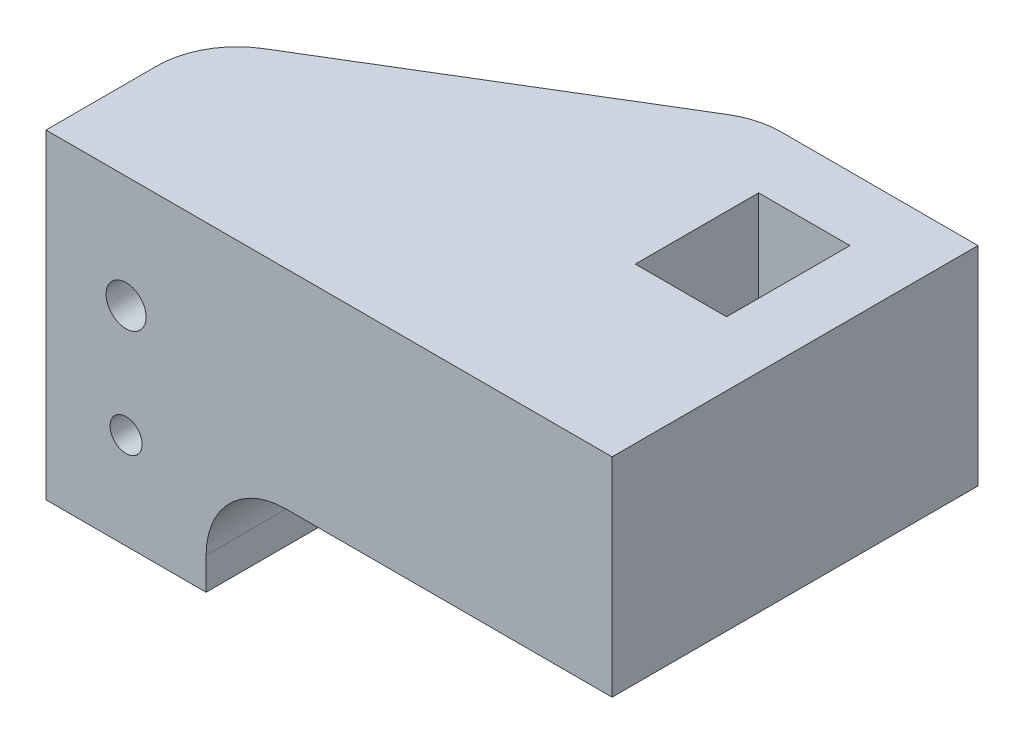
ISO-10303-21;
HEADER;
FILE_DESCRIPTION(('STEP AP214'),'2;1');
FILE_NAME('part.step','',(''),(''),'','','');
FILE_SCHEMA(('AUTOMOTIVE_DESIGN { 1 0 10303 214 1 1 1 1 }'));
ENDSEC;
DATA;
#1=APPLICATION_CONTEXT('core data for automotive mechanical design processes');
#2=APPLICATION_PROTOCOL_DEFINITION('international standard','automotive_design',2000,#1);
#3=PRODUCT_CONTEXT('',#1,'mechanical');
#4=PRODUCT('Part','Part','',(#3));
#5=PRODUCT_RELATED_PRODUCT_CATEGORY('part','',(#4));
#6=PRODUCT_DEFINITION_FORMATION('','',#4);
#7=PRODUCT_DEFINITION_CONTEXT('part definition',#1,'design');
#8=PRODUCT_DEFINITION('design','',#6,#7);
#9=PRODUCT_DEFINITION_SHAPE('','',#8);
#10=(LENGTH_UNIT() NAMED_UNIT(*) SI_UNIT(.MILLI.,.METRE.));
#11=(NAMED_UNIT(*) PLANE_ANGLE_UNIT() SI_UNIT($,.RADIAN.));
#12=(NAMED_UNIT(*) SI_UNIT($,.STERADIAN.) SOLID_ANGLE_UNIT());
#13=UNCERTAINTY_MEASURE_WITH_UNIT(LENGTH_MEASURE(1.E-05),#10,'distance_accuracy_value','');
#14=(GEOMETRIC_REPRESENTATION_CONTEXT(3) GLOBAL_UNCERTAINTY_ASSIGNED_CONTEXT((#13)) GLOBAL_UNIT_ASSIGNED_CONTEXT((#10,
#11,#12)) REPRESENTATION_CONTEXT('',''));
#15=CARTESIAN_POINT('',(0.,0.,0.));
#16=DIRECTION('',(0.,0.,1.));
#17=DIRECTION('',(1.,0.,0.));
#18=AXIS2_PLACEMENT_3D('',#15,#16,#17);
#19=CARTESIAN_POINT('',(0.,20.,0.));
#20=DIRECTION('',(0.,1.,0.));
#21=DIRECTION('',(0.,0.,1.));
#22=AXIS2_PLACEMENT_3D('',#19,#20,#21);
#23=PLANE('',#22);
#24=DIRECTION('',(-1.,0.,0.));
#25=VECTOR('',#24,1.);
#26=CARTESIAN_POINT('',(-25.65,20.,-17.85));
#27=LINE('',#26,#25);
#28=CARTESIAN_POINT('',(-25.65,20.,-17.85));
#29=VERTEX_POINT('',#28);
#30=CARTESIAN_POINT('',(-37.9550666763264,20.,-17.85));
#31=VERTEX_POINT('',#30);
#32=EDGE_CURVE('E160',#29,#31,#27,.T.);
#33=ORIENTED_EDGE('',*,*,#32,.T.);
#34=CARTESIAN_POINT('',(-37.9550666763264,20.,-12.85));
#35=DIRECTION('',(0.,1.,0.));
#36=DIRECTION('',(0.,0.,1.));
#37=AXIS2_PLACEMENT_3D('',#34,#35,#36);
#38=CIRCLE('',#37,5.);
#39=CARTESIAN_POINT('',(-40.5434687758837,20.,-17.1278703312522));
#40=VERTEX_POINT('',#39);
#41=EDGE_CURVE('E204',#31,#40,#38,.T.);
#42=ORIENTED_EDGE('',*,*,#41,.T.);
#43=DIRECTION('',(-0.855574066250431,0.,0.517680419911457));
#44=VECTOR('',#43,1.);
#45=CARTESIAN_POINT('',(-39.35,20.,-17.85));
#46=LINE('',#45,#44);
#47=CARTESIAN_POINT('',(-58.5884020995573,20.,-6.20946007460082));
#48=VERTEX_POINT('',#47);
#49=EDGE_CURVE('E161',#40,#48,#46,.T.);
#50=ORIENTED_EDGE('',*,*,#49,.T.);
#51=CARTESIAN_POINT('',(-56.,20.,-1.93158974334867));
#52=DIRECTION('',(0.,1.,0.));
#53=DIRECTION('',(0.,0.,1.));
#54=AXIS2_PLACEMENT_3D('',#51,#52,#53);
#55=CIRCLE('',#54,5.);
#56=CARTESIAN_POINT('',(-61.,20.,-1.93158974334867));
#57=VERTEX_POINT('',#56);
#58=EDGE_CURVE('E54',#48,#57,#55,.T.);
#59=ORIENTED_EDGE('',*,*,#58,.T.);
#60=DIRECTION('',(0.,0.,1.));
#61=VECTOR('',#60,1.);
#62=CARTESIAN_POINT('',(-61.,20.,-4.75027955124758));
#63=LINE('',#62,#61);
#64=CARTESIAN_POINT('',(-61.,20.,5.00000000000001));
#65=VERTEX_POINT('',#64);
#66=EDGE_CURVE('E211',#57,#65,#63,.T.);
#67=ORIENTED_EDGE('',*,*,#66,.T.);
#68=DIRECTION('',(1.,0.,0.));
#69=VECTOR('',#68,1.);
#70=CARTESIAN_POINT('',(-61.,20.,5.00000000000001));
#71=LINE('',#70,#69);
#72=CARTESIAN_POINT('',(-25.65,20.,5.00000000000001));
#73=VERTEX_POINT('',#72);
#74=EDGE_CURVE('E228',#65,#73,#71,.T.);
#75=ORIENTED_EDGE('',*,*,#74,.T.);
#76=DIRECTION('',(0.,0.,-1.));
#77=VECTOR('',#76,1.);
#78=CARTESIAN_POINT('',(-25.65,20.,5.00000000000001));
#79=LINE('',#78,#77);
#80=EDGE_CURVE('E226',#73,#29,#79,.T.);
#81=ORIENTED_EDGE('',*,*,#80,.T.);
#82=EDGE_LOOP('',(#33,#42,#50,#59,#67,#75,#81));
#83=FACE_BOUND('',#82,.T.);
#84=DIRECTION('',(1.,0.,0.));
#85=VECTOR('',#84,1.);
#86=CARTESIAN_POINT('',(-35.35,20.,-6.15));
#87=LINE('',#86,#85);
#88=CARTESIAN_POINT('',(-35.35,20.,-6.15));
#89=VERTEX_POINT('',#88);
#90=CARTESIAN_POINT('',(-29.65,20.,-6.15));
#91=VERTEX_POINT('',#90);
#92=EDGE_CURVE('E244',#89,#91,#87,.T.);
#93=ORIENTED_EDGE('',*,*,#92,.F.);
#94=DIRECTION('',(0.,0.,1.));
#95=VECTOR('',#94,1.);
#96=CARTESIAN_POINT('',(-35.35,20.,-13.85));
#97=LINE('',#96,#95);
#98=CARTESIAN_POINT('',(-35.35,20.,-13.85));
#99=VERTEX_POINT('',#98);
#100=EDGE_CURVE('E176',#99,#89,#97,.T.);
#101=ORIENTED_EDGE('',*,*,#100,.F.);
#102=DIRECTION('',(-1.,0.,0.));
#103=VECTOR('',#102,1.);
#104=CARTESIAN_POINT('',(-35.35,20.,-13.85));
#105=LINE('',#104,#103);
#106=CARTESIAN_POINT('',(-29.65,20.,-13.85));
#107=VERTEX_POINT('',#106);
#108=EDGE_CURVE('E239',#107,#99,#105,.T.);
#109=ORIENTED_EDGE('',*,*,#108,.F.);
#110=DIRECTION('',(0.,0.,-1.));
#111=VECTOR('',#110,1.);
#112=CARTESIAN_POINT('',(-29.65,20.,-13.85));
#113=LINE('',#112,#111);
#114=EDGE_CURVE('E241',#91,#107,#113,.T.);
#115=ORIENTED_EDGE('',*,*,#114,.F.);
#116=EDGE_LOOP('',(#93,#101,#109,#115));
#117=FACE_BOUND('',#116,.T.);
#118=ADVANCED_FACE('F33',(#83,#117),#23,.T.);
#119=CARTESIAN_POINT('',(0.,0.,0.));
#120=DIRECTION('',(0.,1.,0.));
#121=DIRECTION('',(0.,0.,1.));
#122=AXIS2_PLACEMENT_3D('',#119,#120,#121);
#123=PLANE('',#122);
#124=DIRECTION('',(0.,0.,1.));
#125=VECTOR('',#124,1.);
#126=CARTESIAN_POINT('',(-61.,0.,-4.75027955124758));
#127=LINE('',#126,#125);
#128=CARTESIAN_POINT('',(-61.,0.,-1.93158974334867));
#129=VERTEX_POINT('',#128);
#130=CARTESIAN_POINT('',(-61.,0.,5.00000000000001));
#131=VERTEX_POINT('',#130);
#132=EDGE_CURVE('E209',#129,#131,#127,.T.);
#133=ORIENTED_EDGE('',*,*,#132,.F.);
#134=CARTESIAN_POINT('',(-56.,0.,-1.93158974334867));
#135=DIRECTION('',(0.,1.,0.));
#136=DIRECTION('',(0.,0.,1.));
#137=AXIS2_PLACEMENT_3D('',#134,#135,#136);
#138=CIRCLE('',#137,5.);
#139=CARTESIAN_POINT('',(-58.5884020995573,0.,-6.20946007460082));
#140=VERTEX_POINT('',#139);
#141=EDGE_CURVE('E11',#129,#140,#138,.F.);
#142=ORIENTED_EDGE('',*,*,#141,.T.);
#143=DIRECTION('',(-0.855574066250431,0.,0.517680419911457));
#144=VECTOR('',#143,1.);
#145=CARTESIAN_POINT('',(-39.35,0.,-17.85));
#146=LINE('',#145,#144);
#147=CARTESIAN_POINT('',(-51.,0.,-10.8009587423572));
#148=VERTEX_POINT('',#147);
#149=EDGE_CURVE('E167',#148,#140,#146,.T.);
#150=ORIENTED_EDGE('',*,*,#149,.F.);
#151=DIRECTION('',(0.,0.,1.));
#152=VECTOR('',#151,1.);
#153=CARTESIAN_POINT('',(-51.,0.,-17.85));
#154=LINE('',#153,#152);
#155=CARTESIAN_POINT('',(-51.,0.,5.00000000000001));
#156=VERTEX_POINT('',#155);
#157=EDGE_CURVE('E144',#148,#156,#154,.T.);
#158=ORIENTED_EDGE('',*,*,#157,.T.);
#159=DIRECTION('',(1.,0.,0.));
#160=VECTOR('',#159,1.);
#161=CARTESIAN_POINT('',(-51.5842691136,0.,5.00000000000001));
#162=LINE('',#161,#160);
#163=EDGE_CURVE('E218',#131,#156,#162,.T.);
#164=ORIENTED_EDGE('',*,*,#163,.F.);
#165=EDGE_LOOP('',(#133,#142,#150,#158,#164));
#166=FACE_BOUND('',#165,.T.);
#167=ADVANCED_FACE('F213',(#166),#123,.F.);
#168=CARTESIAN_POINT('',(-61.,20.,-4.75027955124758));
#169=DIRECTION('',(1.,0.,0.));
#170=DIRECTION('',(0.,0.,-1.));
#171=AXIS2_PLACEMENT_3D('',#168,#169,#170);
#172=PLANE('',#171);
#173=ORIENTED_EDGE('',*,*,#66,.F.);
#174=DIRECTION('',(0.,-1.,0.));
#175=VECTOR('',#174,1.);
#176=CARTESIAN_POINT('',(-61.,20.,-1.93158974334867));
#177=LINE('',#176,#175);
#178=EDGE_CURVE('E41',#57,#129,#177,.T.);
#179=ORIENTED_EDGE('',*,*,#178,.T.);
#180=ORIENTED_EDGE('',*,*,#132,.T.);
#181=DIRECTION('',(0.,-1.,0.));
#182=VECTOR('',#181,1.);
#183=CARTESIAN_POINT('',(-61.,20.,5.00000000000001));
#184=LINE('',#183,#182);
#185=EDGE_CURVE('E163',#65,#131,#184,.T.);
#186=ORIENTED_EDGE('',*,*,#185,.F.);
#187=EDGE_LOOP('',(#173,#179,#180,#186));
#188=FACE_BOUND('',#187,.T.);
#189=ADVANCED_FACE('F207',(#188),#172,.F.);
#190=CARTESIAN_POINT('',(-51.5842691136,20.,5.00000000000001));
#191=DIRECTION('',(0.,0.,-1.));
#192=DIRECTION('',(-1.,0.,0.));
#193=AXIS2_PLACEMENT_3D('',#190,#191,#192);
#194=PLANE('',#193);
#195=CARTESIAN_POINT('',(-56.,5.99990119850436,5.00000000000001));
#196=DIRECTION('',(0.,0.,1.));
#197=DIRECTION('',(1.,0.,0.));
#198=AXIS2_PLACEMENT_3D('',#195,#196,#197);
#199=CIRCLE('',#198,0.999999999999998);
#200=CARTESIAN_POINT('',(-55.,5.99990119850436,5.00000000000001));
#201=VERTEX_POINT('',#200);
#202=EDGE_CURVE('E156',#201,#201,#199,.T.);
#203=ORIENTED_EDGE('',*,*,#202,.F.);
#204=EDGE_LOOP('',(#203));
#205=FACE_BOUND('',#204,.T.);
#206=CARTESIAN_POINT('',(-56.,12.9999011985044,5.00000000000001));
#207=DIRECTION('',(0.,0.,1.));
#208=DIRECTION('',(1.,0.,0.));
#209=AXIS2_PLACEMENT_3D('',#206,#207,#208);
#210=CIRCLE('',#209,1.25000000000001);
#211=CARTESIAN_POINT('',(-54.75,12.9999011985044,5.00000000000001));
#212=VERTEX_POINT('',#211);
#213=EDGE_CURVE('E177',#212,#212,#210,.T.);
#214=ORIENTED_EDGE('',*,*,#213,.F.);
#215=EDGE_LOOP('',(#214));
#216=FACE_BOUND('',#215,.T.);
#217=ORIENTED_EDGE('',*,*,#163,.T.);
#218=DIRECTION('',(0.,-1.,0.));
#219=VECTOR('',#218,1.);
#220=CARTESIAN_POINT('',(-51.,0.,5.00000000000001));
#221=LINE('',#220,#219);
#222=CARTESIAN_POINT('',(-51.,2.,5.00000000000001));
#223=VERTEX_POINT('',#222);
#224=EDGE_CURVE('E258',#223,#156,#221,.T.);
#225=ORIENTED_EDGE('',*,*,#224,.F.);
#226=CARTESIAN_POINT('',(-46.,2.,5.00000000000001));
#227=DIRECTION('',(0.,0.,-1.));
#228=DIRECTION('',(-1.,0.,0.));
#229=AXIS2_PLACEMENT_3D('',#226,#227,#228);
#230=CIRCLE('',#229,5.);
#231=CARTESIAN_POINT('',(-46.,7.,5.00000000000001));
#232=VERTEX_POINT('',#231);
#233=EDGE_CURVE('E191',#223,#232,#230,.T.);
#234=ORIENTED_EDGE('',*,*,#233,.T.);
#235=DIRECTION('',(-1.,0.,0.));
#236=VECTOR('',#235,1.);
#237=CARTESIAN_POINT('',(-51.,7.,5.00000000000001));
#238=LINE('',#237,#236);
#239=CARTESIAN_POINT('',(-25.65,7.,5.00000000000001));
#240=VERTEX_POINT('',#239);
#241=EDGE_CURVE('E145',#240,#232,#238,.T.);
#242=ORIENTED_EDGE('',*,*,#241,.F.);
#243=DIRECTION('',(0.,-1.,0.));
#244=VECTOR('',#243,1.);
#245=CARTESIAN_POINT('',(-25.65,20.,5.00000000000001));
#246=LINE('',#245,#244);
#247=EDGE_CURVE('E155',#73,#240,#246,.T.);
#248=ORIENTED_EDGE('',*,*,#247,.F.);
#249=ORIENTED_EDGE('',*,*,#74,.F.);
#250=ORIENTED_EDGE('',*,*,#185,.T.);
#251=EDGE_LOOP('',(#217,#225,#234,#242,#248,#249,#250));
#252=FACE_BOUND('',#251,.T.);
#253=ADVANCED_FACE('F266',(#205,#216,#252),#194,.F.);
#254=CARTESIAN_POINT('',(-25.65,20.,5.00000000000001));
#255=DIRECTION('',(-1.,0.,0.));
#256=DIRECTION('',(0.,0.,1.));
#257=AXIS2_PLACEMENT_3D('',#254,#255,#256);
#258=PLANE('',#257);
#259=ORIENTED_EDGE('',*,*,#247,.T.);
#260=DIRECTION('',(0.,0.,1.));
#261=VECTOR('',#260,1.);
#262=CARTESIAN_POINT('',(-25.65,7.,-17.85));
#263=LINE('',#262,#261);
#264=CARTESIAN_POINT('',(-25.65,7.,-17.85));
#265=VERTEX_POINT('',#264);
#266=EDGE_CURVE('E138',#265,#240,#263,.T.);
#267=ORIENTED_EDGE('',*,*,#266,.F.);
#268=DIRECTION('',(0.,-1.,0.));
#269=VECTOR('',#268,1.);
#270=CARTESIAN_POINT('',(-25.65,20.,-17.85));
#271=LINE('',#270,#269);
#272=EDGE_CURVE('E152',#29,#265,#271,.T.);
#273=ORIENTED_EDGE('',*,*,#272,.F.);
#274=ORIENTED_EDGE('',*,*,#80,.F.);
#275=EDGE_LOOP('',(#259,#267,#273,#274));
#276=FACE_BOUND('',#275,.T.);
#277=ADVANCED_FACE('F150',(#276),#258,.F.);
#278=CARTESIAN_POINT('',(-25.65,20.,-17.85));
#279=DIRECTION('',(0.,0.,1.));
#280=DIRECTION('',(1.,0.,0.));
#281=AXIS2_PLACEMENT_3D('',#278,#279,#280);
#282=PLANE('',#281);
#283=DIRECTION('',(-1.,0.,0.));
#284=VECTOR('',#283,1.);
#285=CARTESIAN_POINT('',(-51.,7.,-17.85));
#286=LINE('',#285,#284);
#287=CARTESIAN_POINT('',(-37.9550666763264,7.,-17.85));
#288=VERTEX_POINT('',#287);
#289=EDGE_CURVE('E133',#265,#288,#286,.T.);
#290=ORIENTED_EDGE('',*,*,#289,.T.);
#291=DIRECTION('',(0.,-1.,0.));
#292=VECTOR('',#291,1.);
#293=CARTESIAN_POINT('',(-37.9550666763264,20.,-17.85));
#294=LINE('',#293,#292);
#295=EDGE_CURVE('E201',#288,#31,#294,.F.);
#296=ORIENTED_EDGE('',*,*,#295,.T.);
#297=ORIENTED_EDGE('',*,*,#32,.F.);
#298=ORIENTED_EDGE('',*,*,#272,.T.);
#299=EDGE_LOOP('',(#290,#296,#297,#298));
#300=FACE_BOUND('',#299,.T.);
#301=ADVANCED_FACE('F158',(#300),#282,.F.);
#302=CARTESIAN_POINT('',(-39.35,20.,-17.85));
#303=DIRECTION('',(0.517680419911457,0.,0.855574066250431));
#304=DIRECTION('',(0.855574066250431,0.,-0.517680419911457));
#305=AXIS2_PLACEMENT_3D('',#302,#303,#304);
#306=PLANE('',#305);
#307=CARTESIAN_POINT('',(-56.,5.99990119850436,-7.77561914680241));
#308=DIRECTION('',(0.517680419911457,0.,0.855574066250431));
#309=DIRECTION('',(-0.855574066250431,0.,0.517680419911457));
#310=AXIS2_PLACEMENT_3D('',#307,#308,#309);
#311=ELLIPSE('',#310,1.16880588069075,0.999999999999998);
#312=CARTESIAN_POINT('',(-57.,5.99990119850436,-7.17055122769144));
#313=VERTEX_POINT('',#312);
#314=EDGE_CURVE('E182',#313,#313,#311,.T.);
#315=ORIENTED_EDGE('',*,*,#314,.T.);
#316=EDGE_LOOP('',(#315));
#317=FACE_BOUND('',#316,.T.);
#318=CARTESIAN_POINT('',(-56.,12.9999011985044,-7.77561914680241));
#319=DIRECTION('',(0.517680419911457,0.,0.855574066250431));
#320=DIRECTION('',(-0.855574066250431,0.,0.517680419911457));
#321=AXIS2_PLACEMENT_3D('',#318,#319,#320);
#322=ELLIPSE('',#321,1.46100735086344,1.25000000000001);
#323=CARTESIAN_POINT('',(-57.25,12.9999011985044,-7.01928424791369));
#324=VERTEX_POINT('',#323);
#325=EDGE_CURVE('E173',#324,#324,#322,.T.);
#326=ORIENTED_EDGE('',*,*,#325,.T.);
#327=EDGE_LOOP('',(#326));
#328=FACE_BOUND('',#327,.T.);
#329=ORIENTED_EDGE('',*,*,#49,.F.);
#330=DIRECTION('',(0.,-1.,0.));
#331=VECTOR('',#330,1.);
#332=CARTESIAN_POINT('',(-40.5434687758837,20.,-17.1278703312522));
#333=LINE('',#332,#331);
#334=CARTESIAN_POINT('',(-40.5434687758837,7.,-17.1278703312522));
#335=VERTEX_POINT('',#334);
#336=EDGE_CURVE('E197',#40,#335,#333,.T.);
#337=ORIENTED_EDGE('',*,*,#336,.T.);
#338=DIRECTION('',(-0.855574066250432,0.,0.517680419911457));
#339=VECTOR('',#338,1.);
#340=CARTESIAN_POINT('',(-39.35,7.,-17.85));
#341=LINE('',#340,#339);
#342=CARTESIAN_POINT('',(-46.,7.,-13.8262983379121));
#343=VERTEX_POINT('',#342);
#344=EDGE_CURVE('E185',#335,#343,#341,.T.);
#345=ORIENTED_EDGE('',*,*,#344,.T.);
#346=CARTESIAN_POINT('',(-46.,2.,-13.8262983379121));
#347=DIRECTION('',(0.517680419911457,0.,0.855574066250431));
#348=DIRECTION('',(0.855574066250431,0.,-0.517680419911457));
#349=AXIS2_PLACEMENT_3D('',#346,#347,#348);
#350=ELLIPSE('',#349,5.84402940345374,5.);
#351=CARTESIAN_POINT('',(-51.,2.00000000000001,-10.8009587423572));
#352=VERTEX_POINT('',#351);
#353=EDGE_CURVE('E193',#343,#352,#350,.T.);
#354=ORIENTED_EDGE('',*,*,#353,.T.);
#355=DIRECTION('',(0.,-1.,0.));
#356=VECTOR('',#355,1.);
#357=CARTESIAN_POINT('',(-51.,20.,-10.8009587423572));
#358=LINE('',#357,#356);
#359=EDGE_CURVE('E179',#352,#148,#358,.T.);
#360=ORIENTED_EDGE('',*,*,#359,.T.);
#361=ORIENTED_EDGE('',*,*,#149,.T.);
#362=DIRECTION('',(0.,-1.,0.));
#363=VECTOR('',#362,1.);
#364=CARTESIAN_POINT('',(-58.5884020995573,20.,-6.20946007460082));
#365=LINE('',#364,#363);
#366=EDGE_CURVE('E195',#140,#48,#365,.F.);
#367=ORIENTED_EDGE('',*,*,#366,.T.);
#368=EDGE_LOOP('',(#329,#337,#345,#354,#360,#361,#367));
#369=FACE_BOUND('',#368,.T.);
#370=ADVANCED_FACE('F281',(#317,#328,#369),#306,.F.);
#371=CARTESIAN_POINT('',(-35.35,20.,-13.85));
#372=DIRECTION('',(1.,0.,0.));
#373=DIRECTION('',(0.,0.,-1.));
#374=AXIS2_PLACEMENT_3D('',#371,#372,#373);
#375=PLANE('',#374);
#376=DIRECTION('',(0.,0.,1.));
#377=VECTOR('',#376,1.);
#378=CARTESIAN_POINT('',(-35.35,7.,-13.85));
#379=LINE('',#378,#377);
#380=CARTESIAN_POINT('',(-35.35,7.,-13.85));
#381=VERTEX_POINT('',#380);
#382=CARTESIAN_POINT('',(-35.35,7.,-6.15));
#383=VERTEX_POINT('',#382);
#384=EDGE_CURVE('E250',#381,#383,#379,.T.);
#385=ORIENTED_EDGE('',*,*,#384,.F.);
#386=DIRECTION('',(0.,-1.,0.));
#387=VECTOR('',#386,1.);
#388=CARTESIAN_POINT('',(-35.35,20.,-13.85));
#389=LINE('',#388,#387);
#390=EDGE_CURVE('E236',#99,#381,#389,.T.);
#391=ORIENTED_EDGE('',*,*,#390,.F.);
#392=ORIENTED_EDGE('',*,*,#100,.T.);
#393=DIRECTION('',(0.,-1.,0.));
#394=VECTOR('',#393,1.);
#395=CARTESIAN_POINT('',(-35.35,20.,-6.15));
#396=LINE('',#395,#394);
#397=EDGE_CURVE('E219',#89,#383,#396,.T.);
#398=ORIENTED_EDGE('',*,*,#397,.T.);
#399=EDGE_LOOP('',(#385,#391,#392,#398));
#400=FACE_BOUND('',#399,.T.);
#401=ADVANCED_FACE('F302',(#400),#375,.T.);
#402=CARTESIAN_POINT('',(-35.35,20.,-6.15));
#403=DIRECTION('',(0.,0.,-1.));
#404=DIRECTION('',(-1.,0.,0.));
#405=AXIS2_PLACEMENT_3D('',#402,#403,#404);
#406=PLANE('',#405);
#407=DIRECTION('',(1.,0.,0.));
#408=VECTOR('',#407,1.);
#409=CARTESIAN_POINT('',(-35.35,7.,-6.15));
#410=LINE('',#409,#408);
#411=CARTESIAN_POINT('',(-29.65,7.,-6.15));
#412=VERTEX_POINT('',#411);
#413=EDGE_CURVE('E252',#383,#412,#410,.T.);
#414=ORIENTED_EDGE('',*,*,#413,.F.);
#415=ORIENTED_EDGE('',*,*,#397,.F.);
#416=ORIENTED_EDGE('',*,*,#92,.T.);
#417=DIRECTION('',(0.,-1.,0.));
#418=VECTOR('',#417,1.);
#419=CARTESIAN_POINT('',(-29.65,20.,-6.15));
#420=LINE('',#419,#418);
#421=EDGE_CURVE('E222',#91,#412,#420,.T.);
#422=ORIENTED_EDGE('',*,*,#421,.T.);
#423=EDGE_LOOP('',(#414,#415,#416,#422));
#424=FACE_BOUND('',#423,.T.);
#425=ADVANCED_FACE('F337',(#424),#406,.T.);
#426=CARTESIAN_POINT('',(-29.65,20.,-13.85));
#427=DIRECTION('',(-1.,0.,0.));
#428=DIRECTION('',(0.,0.,1.));
#429=AXIS2_PLACEMENT_3D('',#426,#427,#428);
#430=PLANE('',#429);
#431=DIRECTION('',(0.,0.,-1.));
#432=VECTOR('',#431,1.);
#433=CARTESIAN_POINT('',(-29.65,7.,-13.85));
#434=LINE('',#433,#432);
#435=CARTESIAN_POINT('',(-29.65,7.,-13.85));
#436=VERTEX_POINT('',#435);
#437=EDGE_CURVE('E254',#412,#436,#434,.T.);
#438=ORIENTED_EDGE('',*,*,#437,.F.);
#439=ORIENTED_EDGE('',*,*,#421,.F.);
#440=ORIENTED_EDGE('',*,*,#114,.T.);
#441=DIRECTION('',(0.,-1.,0.));
#442=VECTOR('',#441,1.);
#443=CARTESIAN_POINT('',(-29.65,20.,-13.85));
#444=LINE('',#443,#442);
#445=EDGE_CURVE('E233',#107,#436,#444,.T.);
#446=ORIENTED_EDGE('',*,*,#445,.T.);
#447=EDGE_LOOP('',(#438,#439,#440,#446));
#448=FACE_BOUND('',#447,.T.);
#449=ADVANCED_FACE('F334',(#448),#430,.T.);
#450=CARTESIAN_POINT('',(-35.35,20.,-13.85));
#451=DIRECTION('',(0.,0.,1.));
#452=DIRECTION('',(1.,0.,0.));
#453=AXIS2_PLACEMENT_3D('',#450,#451,#452);
#454=PLANE('',#453);
#455=DIRECTION('',(-1.,0.,0.));
#456=VECTOR('',#455,1.);
#457=CARTESIAN_POINT('',(-35.35,7.,-13.85));
#458=LINE('',#457,#456);
#459=EDGE_CURVE('E172',#436,#381,#458,.T.);
#460=ORIENTED_EDGE('',*,*,#459,.F.);
#461=ORIENTED_EDGE('',*,*,#445,.F.);
#462=ORIENTED_EDGE('',*,*,#108,.T.);
#463=ORIENTED_EDGE('',*,*,#390,.T.);
#464=EDGE_LOOP('',(#460,#461,#462,#463));
#465=FACE_BOUND('',#464,.T.);
#466=ADVANCED_FACE('F330',(#465),#454,.T.);
#467=CARTESIAN_POINT('',(-56.,12.9999011985044,-17.85));
#468=DIRECTION('',(0.,0.,1.));
#469=DIRECTION('',(1.,0.,0.));
#470=AXIS2_PLACEMENT_3D('',#467,#468,#469);
#471=CYLINDRICAL_SURFACE('',#470,1.25000000000001);
#472=ORIENTED_EDGE('',*,*,#213,.T.);
#473=EDGE_LOOP('',(#472));
#474=FACE_BOUND('',#473,.T.);
#475=ORIENTED_EDGE('',*,*,#325,.F.);
#476=EDGE_LOOP('',(#475));
#477=FACE_BOUND('',#476,.T.);
#478=ADVANCED_FACE('F327',(#474,#477),#471,.F.);
#479=CARTESIAN_POINT('',(-51.,0.,-17.85));
#480=DIRECTION('',(-1.,0.,0.));
#481=DIRECTION('',(0.,0.,1.));
#482=AXIS2_PLACEMENT_3D('',#479,#480,#481);
#483=PLANE('',#482);
#484=ORIENTED_EDGE('',*,*,#359,.F.);
#485=DIRECTION('',(0.,0.,1.));
#486=VECTOR('',#485,1.);
#487=CARTESIAN_POINT('',(-51.,2.,5.00000000000001));
#488=LINE('',#487,#486);
#489=EDGE_CURVE('E181',#352,#223,#488,.T.);
#490=ORIENTED_EDGE('',*,*,#489,.T.);
#491=ORIENTED_EDGE('',*,*,#224,.T.);
#492=ORIENTED_EDGE('',*,*,#157,.F.);
#493=EDGE_LOOP('',(#484,#490,#491,#492));
#494=FACE_BOUND('',#493,.T.);
#495=ADVANCED_FACE('F290',(#494),#483,.F.);
#496=CARTESIAN_POINT('',(-51.,7.,-17.85));
#497=DIRECTION('',(0.,1.,0.));
#498=DIRECTION('',(0.,0.,1.));
#499=AXIS2_PLACEMENT_3D('',#496,#497,#498);
#500=PLANE('',#499);
#501=ORIENTED_EDGE('',*,*,#384,.T.);
#502=ORIENTED_EDGE('',*,*,#413,.T.);
#503=ORIENTED_EDGE('',*,*,#437,.T.);
#504=ORIENTED_EDGE('',*,*,#459,.T.);
#505=EDGE_LOOP('',(#501,#502,#503,#504));
#506=FACE_BOUND('',#505,.T.);
#507=ORIENTED_EDGE('',*,*,#344,.F.);
#508=CARTESIAN_POINT('',(-37.9550666763264,7.,-12.85));
#509=DIRECTION('',(0.,1.,0.));
#510=DIRECTION('',(0.,0.,1.));
#511=AXIS2_PLACEMENT_3D('',#508,#509,#510);
#512=CIRCLE('',#511,5.);
#513=EDGE_CURVE('E140',#335,#288,#512,.F.);
#514=ORIENTED_EDGE('',*,*,#513,.T.);
#515=ORIENTED_EDGE('',*,*,#289,.F.);
#516=ORIENTED_EDGE('',*,*,#266,.T.);
#517=ORIENTED_EDGE('',*,*,#241,.T.);
#518=DIRECTION('',(0.,0.,1.));
#519=VECTOR('',#518,1.);
#520=CARTESIAN_POINT('',(-46.,7.,-10.8009587423572));
#521=LINE('',#520,#519);
#522=EDGE_CURVE('E188',#232,#343,#521,.F.);
#523=ORIENTED_EDGE('',*,*,#522,.T.);
#524=EDGE_LOOP('',(#507,#514,#515,#516,#517,#523));
#525=FACE_BOUND('',#524,.T.);
#526=ADVANCED_FACE('F136',(#506,#525),#500,.F.);
#527=CARTESIAN_POINT('',(-56.,5.99990119850436,-17.85));
#528=DIRECTION('',(0.,0.,1.));
#529=DIRECTION('',(1.,0.,0.));
#530=AXIS2_PLACEMENT_3D('',#527,#528,#529);
#531=CYLINDRICAL_SURFACE('',#530,0.999999999999998);
#532=ORIENTED_EDGE('',*,*,#202,.T.);
#533=EDGE_LOOP('',(#532));
#534=FACE_BOUND('',#533,.T.);
#535=ORIENTED_EDGE('',*,*,#314,.F.);
#536=EDGE_LOOP('',(#535));
#537=FACE_BOUND('',#536,.T.);
#538=ADVANCED_FACE('F263',(#534,#537),#531,.F.);
#539=CARTESIAN_POINT('',(-46.,2.,-17.85));
#540=DIRECTION('',(0.,0.,-1.));
#541=DIRECTION('',(-1.,0.,0.));
#542=AXIS2_PLACEMENT_3D('',#539,#540,#541);
#543=CYLINDRICAL_SURFACE('',#542,5.);
#544=ORIENTED_EDGE('',*,*,#353,.F.);
#545=ORIENTED_EDGE('',*,*,#522,.F.);
#546=ORIENTED_EDGE('',*,*,#233,.F.);
#547=ORIENTED_EDGE('',*,*,#489,.F.);
#548=EDGE_LOOP('',(#544,#545,#546,#547));
#549=FACE_BOUND('',#548,.T.);
#550=ADVANCED_FACE('F286',(#549),#543,.F.);
#551=CARTESIAN_POINT('',(-37.9550666763264,20.,-12.85));
#552=DIRECTION('',(0.,-1.,0.));
#553=DIRECTION('',(0.,0.,-1.));
#554=AXIS2_PLACEMENT_3D('',#551,#552,#553);
#555=CYLINDRICAL_SURFACE('',#554,5.);
#556=ORIENTED_EDGE('',*,*,#41,.F.);
#557=ORIENTED_EDGE('',*,*,#295,.F.);
#558=ORIENTED_EDGE('',*,*,#513,.F.);
#559=ORIENTED_EDGE('',*,*,#336,.F.);
#560=EDGE_LOOP('',(#556,#557,#558,#559));
#561=FACE_BOUND('',#560,.T.);
#562=ADVANCED_FACE('F279',(#561),#555,.T.);
#563=CARTESIAN_POINT('',(-56.,20.,-1.93158974334867));
#564=DIRECTION('',(0.,-1.,0.));
#565=DIRECTION('',(0.,0.,-1.));
#566=AXIS2_PLACEMENT_3D('',#563,#564,#565);
#567=CYLINDRICAL_SURFACE('',#566,5.);
#568=ORIENTED_EDGE('',*,*,#58,.F.);
#569=ORIENTED_EDGE('',*,*,#366,.F.);
#570=ORIENTED_EDGE('',*,*,#141,.F.);
#571=ORIENTED_EDGE('',*,*,#178,.F.);
#572=EDGE_LOOP('',(#568,#569,#570,#571));
#573=FACE_BOUND('',#572,.T.);
#574=ADVANCED_FACE('F35',(#573),#567,.T.);
#575=CLOSED_SHELL('',(#118,#167,#189,#253,#277,#301,#370,#401,#425,#449,#466,#478,#495,#526,
#538,#550,#562,#574));
#576=MANIFOLD_SOLID_BREP('B2',#575);
#577=ADVANCED_BREP_SHAPE_REPRESENTATION('',(#18,#576),#14);
#578=SHAPE_DEFINITION_REPRESENTATION(#9,#577);
ENDSEC;
END-ISO-10303-21;
